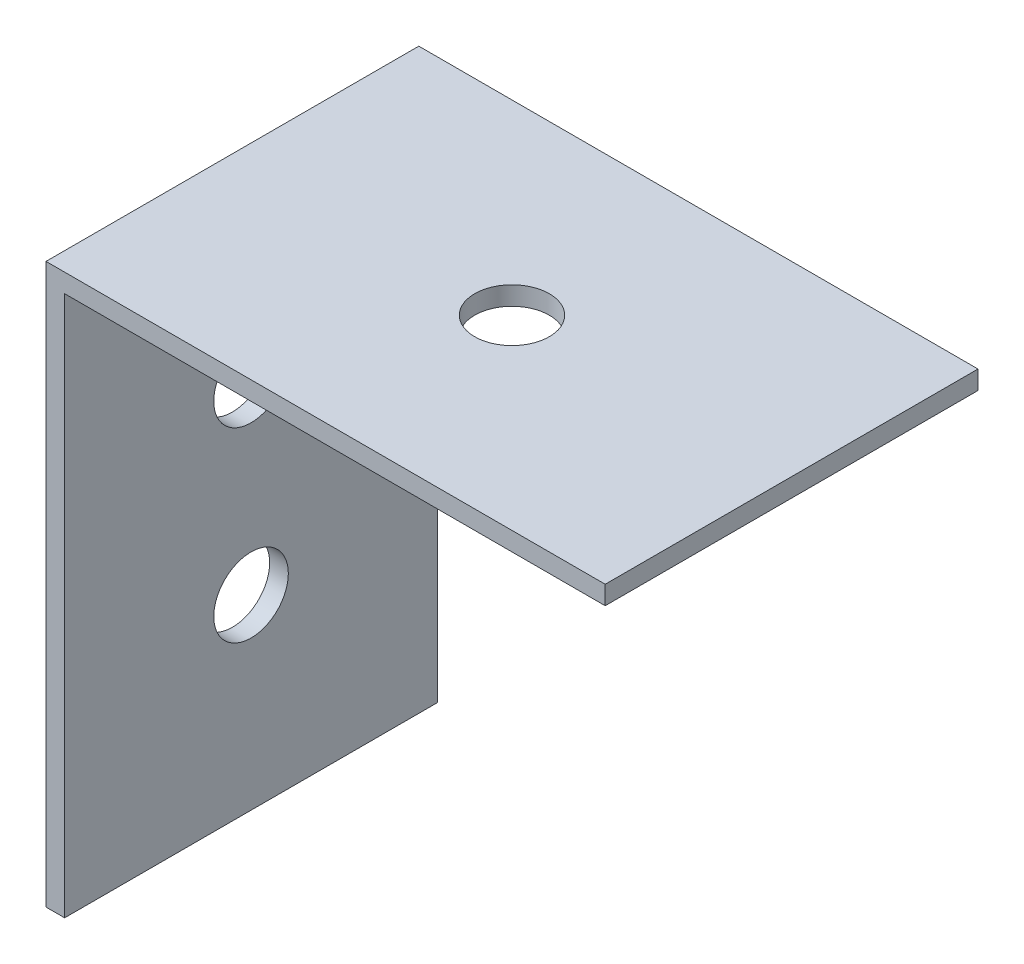
ISO-10303-21;
HEADER;
FILE_DESCRIPTION(('STEP AP214'),'2;1');
FILE_NAME('part.step','',(''),(''),'','','');
FILE_SCHEMA(('AUTOMOTIVE_DESIGN { 1 0 10303 214 1 1 1 1 }'));
ENDSEC;
DATA;
#1=APPLICATION_CONTEXT('core data for automotive mechanical design processes');
#2=APPLICATION_PROTOCOL_DEFINITION('international standard','automotive_design',2000,#1);
#3=PRODUCT_CONTEXT('',#1,'mechanical');
#4=PRODUCT('Part','Part','',(#3));
#5=PRODUCT_RELATED_PRODUCT_CATEGORY('part','',(#4));
#6=PRODUCT_DEFINITION_FORMATION('','',#4);
#7=PRODUCT_DEFINITION_CONTEXT('part definition',#1,'design');
#8=PRODUCT_DEFINITION('design','',#6,#7);
#9=PRODUCT_DEFINITION_SHAPE('','',#8);
#10=(LENGTH_UNIT() NAMED_UNIT(*) SI_UNIT(.MILLI.,.METRE.));
#11=(NAMED_UNIT(*) PLANE_ANGLE_UNIT() SI_UNIT($,.RADIAN.));
#12=(NAMED_UNIT(*) SI_UNIT($,.STERADIAN.) SOLID_ANGLE_UNIT());
#13=UNCERTAINTY_MEASURE_WITH_UNIT(LENGTH_MEASURE(1.E-05),#10,'distance_accuracy_value','');
#14=(GEOMETRIC_REPRESENTATION_CONTEXT(3) GLOBAL_UNCERTAINTY_ASSIGNED_CONTEXT((#13)) GLOBAL_UNIT_ASSIGNED_CONTEXT((#10,
#11,#12)) REPRESENTATION_CONTEXT('',''));
#15=CARTESIAN_POINT('',(0.,0.,0.));
#16=DIRECTION('',(0.,0.,1.));
#17=DIRECTION('',(1.,0.,0.));
#18=AXIS2_PLACEMENT_3D('',#15,#16,#17);
#19=CARTESIAN_POINT('',(1.,0.,0.));
#20=DIRECTION('',(-1.,0.,0.));
#21=DIRECTION('',(0.,0.,1.));
#22=AXIS2_PLACEMENT_3D('',#19,#20,#21);
#23=PLANE('',#22);
#24=CARTESIAN_POINT('',(1.,10.,-10.));
#25=DIRECTION('',(1.,0.,0.));
#26=DIRECTION('',(0.,0.,-1.));
#27=AXIS2_PLACEMENT_3D('',#24,#25,#26);
#28=CIRCLE('',#27,2.);
#29=CARTESIAN_POINT('',(1.,10.,-12.));
#30=VERTEX_POINT('',#29);
#31=EDGE_CURVE('E135',#30,#30,#28,.T.);
#32=ORIENTED_EDGE('',*,*,#31,.F.);
#33=EDGE_LOOP('',(#32));
#34=FACE_BOUND('',#33,.T.);
#35=CARTESIAN_POINT('',(1.,20.,-10.));
#36=DIRECTION('',(1.,0.,0.));
#37=DIRECTION('',(0.,0.,-1.));
#38=AXIS2_PLACEMENT_3D('',#35,#36,#37);
#39=CIRCLE('',#38,2.);
#40=CARTESIAN_POINT('',(1.,20.,-12.));
#41=VERTEX_POINT('',#40);
#42=EDGE_CURVE('E102',#41,#41,#39,.T.);
#43=ORIENTED_EDGE('',*,*,#42,.F.);
#44=EDGE_LOOP('',(#43));
#45=FACE_BOUND('',#44,.T.);
#46=DIRECTION('',(0.,0.,-1.));
#47=VECTOR('',#46,1.);
#48=CARTESIAN_POINT('',(1.,29.,0.));
#49=LINE('',#48,#47);
#50=CARTESIAN_POINT('',(1.,29.,0.));
#51=VERTEX_POINT('',#50);
#52=CARTESIAN_POINT('',(1.,29.,-20.));
#53=VERTEX_POINT('',#52);
#54=EDGE_CURVE('E49',#51,#53,#49,.T.);
#55=ORIENTED_EDGE('',*,*,#54,.F.);
#56=DIRECTION('',(0.,-1.,0.));
#57=VECTOR('',#56,1.);
#58=CARTESIAN_POINT('',(1.,0.,0.));
#59=LINE('',#58,#57);
#60=CARTESIAN_POINT('',(1.,0.,0.));
#61=VERTEX_POINT('',#60);
#62=EDGE_CURVE('E86',#51,#61,#59,.T.);
#63=ORIENTED_EDGE('',*,*,#62,.T.);
#64=DIRECTION('',(0.,0.,-1.));
#65=VECTOR('',#64,1.);
#66=CARTESIAN_POINT('',(1.,0.,0.));
#67=LINE('',#66,#65);
#68=CARTESIAN_POINT('',(1.,0.,-20.));
#69=VERTEX_POINT('',#68);
#70=EDGE_CURVE('E55',#61,#69,#67,.T.);
#71=ORIENTED_EDGE('',*,*,#70,.T.);
#72=DIRECTION('',(0.,1.,0.));
#73=VECTOR('',#72,1.);
#74=CARTESIAN_POINT('',(1.,0.,-20.));
#75=LINE('',#74,#73);
#76=EDGE_CURVE('E97',#69,#53,#75,.T.);
#77=ORIENTED_EDGE('',*,*,#76,.T.);
#78=EDGE_LOOP('',(#55,#63,#71,#77));
#79=FACE_BOUND('',#78,.T.);
#80=ADVANCED_FACE('F33',(#34,#45,#79),#23,.F.);
#81=CARTESIAN_POINT('',(0.,0.,0.));
#82=DIRECTION('',(-1.,0.,0.));
#83=DIRECTION('',(0.,0.,1.));
#84=AXIS2_PLACEMENT_3D('',#81,#82,#83);
#85=PLANE('',#84);
#86=CARTESIAN_POINT('',(0.,20.,-10.));
#87=DIRECTION('',(1.,0.,0.));
#88=DIRECTION('',(0.,0.,-1.));
#89=AXIS2_PLACEMENT_3D('',#86,#87,#88);
#90=CIRCLE('',#89,2.);
#91=CARTESIAN_POINT('',(0.,20.,-12.));
#92=VERTEX_POINT('',#91);
#93=EDGE_CURVE('E106',#92,#92,#90,.T.);
#94=ORIENTED_EDGE('',*,*,#93,.T.);
#95=EDGE_LOOP('',(#94));
#96=FACE_BOUND('',#95,.T.);
#97=DIRECTION('',(0.,-1.,0.));
#98=VECTOR('',#97,1.);
#99=CARTESIAN_POINT('',(0.,0.,0.));
#100=LINE('',#99,#98);
#101=CARTESIAN_POINT('',(0.,30.,0.));
#102=VERTEX_POINT('',#101);
#103=CARTESIAN_POINT('',(0.,0.,0.));
#104=VERTEX_POINT('',#103);
#105=EDGE_CURVE('E93',#102,#104,#100,.T.);
#106=ORIENTED_EDGE('',*,*,#105,.F.);
#107=DIRECTION('',(0.,0.,1.));
#108=VECTOR('',#107,1.);
#109=CARTESIAN_POINT('',(0.,30.,0.));
#110=LINE('',#109,#108);
#111=CARTESIAN_POINT('',(0.,30.,-20.));
#112=VERTEX_POINT('',#111);
#113=EDGE_CURVE('E75',#112,#102,#110,.T.);
#114=ORIENTED_EDGE('',*,*,#113,.F.);
#115=DIRECTION('',(0.,1.,0.));
#116=VECTOR('',#115,1.);
#117=CARTESIAN_POINT('',(0.,0.,-20.));
#118=LINE('',#117,#116);
#119=CARTESIAN_POINT('',(0.,0.,-20.));
#120=VERTEX_POINT('',#119);
#121=EDGE_CURVE('E87',#120,#112,#118,.T.);
#122=ORIENTED_EDGE('',*,*,#121,.F.);
#123=DIRECTION('',(0.,0.,-1.));
#124=VECTOR('',#123,1.);
#125=CARTESIAN_POINT('',(0.,0.,0.));
#126=LINE('',#125,#124);
#127=EDGE_CURVE('E101',#104,#120,#126,.T.);
#128=ORIENTED_EDGE('',*,*,#127,.F.);
#129=EDGE_LOOP('',(#106,#114,#122,#128));
#130=FACE_BOUND('',#129,.T.);
#131=CARTESIAN_POINT('',(0.,10.,-10.));
#132=DIRECTION('',(1.,0.,0.));
#133=DIRECTION('',(0.,0.,-1.));
#134=AXIS2_PLACEMENT_3D('',#131,#132,#133);
#135=CIRCLE('',#134,2.);
#136=CARTESIAN_POINT('',(0.,10.,-12.));
#137=VERTEX_POINT('',#136);
#138=EDGE_CURVE('E131',#137,#137,#135,.T.);
#139=ORIENTED_EDGE('',*,*,#138,.T.);
#140=EDGE_LOOP('',(#139));
#141=FACE_BOUND('',#140,.T.);
#142=ADVANCED_FACE('F99',(#96,#130,#141),#85,.T.);
#143=CARTESIAN_POINT('',(1.,0.,0.));
#144=DIRECTION('',(0.,0.,-1.));
#145=DIRECTION('',(-1.,0.,0.));
#146=AXIS2_PLACEMENT_3D('',#143,#144,#145);
#147=PLANE('',#146);
#148=ORIENTED_EDGE('',*,*,#105,.T.);
#149=DIRECTION('',(-1.,0.,0.));
#150=VECTOR('',#149,1.);
#151=CARTESIAN_POINT('',(1.,0.,0.));
#152=LINE('',#151,#150);
#153=EDGE_CURVE('E11',#61,#104,#152,.T.);
#154=ORIENTED_EDGE('',*,*,#153,.F.);
#155=ORIENTED_EDGE('',*,*,#62,.F.);
#156=DIRECTION('',(-1.,0.,0.));
#157=VECTOR('',#156,1.);
#158=CARTESIAN_POINT('',(30.,29.,0.));
#159=LINE('',#158,#157);
#160=CARTESIAN_POINT('',(30.,29.,0.));
#161=VERTEX_POINT('',#160);
#162=EDGE_CURVE('E122',#161,#51,#159,.T.);
#163=ORIENTED_EDGE('',*,*,#162,.F.);
#164=DIRECTION('',(0.,-1.,0.));
#165=VECTOR('',#164,1.);
#166=CARTESIAN_POINT('',(30.,30.,0.));
#167=LINE('',#166,#165);
#168=CARTESIAN_POINT('',(30.,30.,0.));
#169=VERTEX_POINT('',#168);
#170=EDGE_CURVE('E96',#169,#161,#167,.T.);
#171=ORIENTED_EDGE('',*,*,#170,.F.);
#172=DIRECTION('',(-1.,0.,0.));
#173=VECTOR('',#172,1.);
#174=CARTESIAN_POINT('',(1.,30.,0.));
#175=LINE('',#174,#173);
#176=EDGE_CURVE('E79',#169,#102,#175,.T.);
#177=ORIENTED_EDGE('',*,*,#176,.T.);
#178=EDGE_LOOP('',(#148,#154,#155,#163,#171,#177));
#179=FACE_BOUND('',#178,.T.);
#180=ADVANCED_FACE('F35',(#179),#147,.F.);
#181=CARTESIAN_POINT('',(1.,0.,0.));
#182=DIRECTION('',(0.,1.,0.));
#183=DIRECTION('',(0.,0.,1.));
#184=AXIS2_PLACEMENT_3D('',#181,#182,#183);
#185=PLANE('',#184);
#186=ORIENTED_EDGE('',*,*,#127,.T.);
#187=DIRECTION('',(-1.,0.,0.));
#188=VECTOR('',#187,1.);
#189=CARTESIAN_POINT('',(1.,0.,-20.));
#190=LINE('',#189,#188);
#191=EDGE_CURVE('E42',#69,#120,#190,.T.);
#192=ORIENTED_EDGE('',*,*,#191,.F.);
#193=ORIENTED_EDGE('',*,*,#70,.F.);
#194=ORIENTED_EDGE('',*,*,#153,.T.);
#195=EDGE_LOOP('',(#186,#192,#193,#194));
#196=FACE_BOUND('',#195,.T.);
#197=ADVANCED_FACE('F119',(#196),#185,.F.);
#198=CARTESIAN_POINT('',(1.,0.,-20.));
#199=DIRECTION('',(0.,0.,1.));
#200=DIRECTION('',(1.,0.,0.));
#201=AXIS2_PLACEMENT_3D('',#198,#199,#200);
#202=PLANE('',#201);
#203=ORIENTED_EDGE('',*,*,#121,.T.);
#204=DIRECTION('',(-1.,0.,0.));
#205=VECTOR('',#204,1.);
#206=CARTESIAN_POINT('',(1.,30.,-20.));
#207=LINE('',#206,#205);
#208=CARTESIAN_POINT('',(30.,30.,-20.));
#209=VERTEX_POINT('',#208);
#210=EDGE_CURVE('E82',#209,#112,#207,.T.);
#211=ORIENTED_EDGE('',*,*,#210,.F.);
#212=DIRECTION('',(0.,1.,0.));
#213=VECTOR('',#212,1.);
#214=CARTESIAN_POINT('',(30.,30.,-20.));
#215=LINE('',#214,#213);
#216=CARTESIAN_POINT('',(30.,29.,-20.));
#217=VERTEX_POINT('',#216);
#218=EDGE_CURVE('E154',#217,#209,#215,.T.);
#219=ORIENTED_EDGE('',*,*,#218,.F.);
#220=DIRECTION('',(-1.,0.,0.));
#221=VECTOR('',#220,1.);
#222=CARTESIAN_POINT('',(30.,29.,-20.));
#223=LINE('',#222,#221);
#224=EDGE_CURVE('E132',#217,#53,#223,.T.);
#225=ORIENTED_EDGE('',*,*,#224,.T.);
#226=ORIENTED_EDGE('',*,*,#76,.F.);
#227=ORIENTED_EDGE('',*,*,#191,.T.);
#228=EDGE_LOOP('',(#203,#211,#219,#225,#226,#227));
#229=FACE_BOUND('',#228,.T.);
#230=ADVANCED_FACE('F116',(#229),#202,.F.);
#231=CARTESIAN_POINT('',(1.,30.,0.));
#232=DIRECTION('',(0.,-1.,0.));
#233=DIRECTION('',(0.,0.,-1.));
#234=AXIS2_PLACEMENT_3D('',#231,#232,#233);
#235=PLANE('',#234);
#236=CARTESIAN_POINT('',(15.,30.,-10.));
#237=DIRECTION('',(0.,1.,0.));
#238=DIRECTION('',(0.,0.,1.));
#239=AXIS2_PLACEMENT_3D('',#236,#237,#238);
#240=CIRCLE('',#239,2.);
#241=CARTESIAN_POINT('',(15.,30.,-8.));
#242=VERTEX_POINT('',#241);
#243=EDGE_CURVE('E160',#242,#242,#240,.T.);
#244=ORIENTED_EDGE('',*,*,#243,.F.);
#245=EDGE_LOOP('',(#244));
#246=FACE_BOUND('',#245,.T.);
#247=ORIENTED_EDGE('',*,*,#113,.T.);
#248=ORIENTED_EDGE('',*,*,#176,.F.);
#249=DIRECTION('',(0.,0.,1.));
#250=VECTOR('',#249,1.);
#251=CARTESIAN_POINT('',(30.,30.,0.));
#252=LINE('',#251,#250);
#253=EDGE_CURVE('E137',#209,#169,#252,.T.);
#254=ORIENTED_EDGE('',*,*,#253,.F.);
#255=ORIENTED_EDGE('',*,*,#210,.T.);
#256=EDGE_LOOP('',(#247,#248,#254,#255));
#257=FACE_BOUND('',#256,.T.);
#258=ADVANCED_FACE('F77',(#246,#257),#235,.F.);
#259=CARTESIAN_POINT('',(1.,20.,-10.));
#260=DIRECTION('',(-1.,0.,0.));
#261=DIRECTION('',(0.,0.,1.));
#262=AXIS2_PLACEMENT_3D('',#259,#260,#261);
#263=CYLINDRICAL_SURFACE('',#262,2.);
#264=ORIENTED_EDGE('',*,*,#42,.T.);
#265=EDGE_LOOP('',(#264));
#266=FACE_BOUND('',#265,.T.);
#267=ORIENTED_EDGE('',*,*,#93,.F.);
#268=EDGE_LOOP('',(#267));
#269=FACE_BOUND('',#268,.T.);
#270=ADVANCED_FACE('F171',(#266,#269),#263,.F.);
#271=CARTESIAN_POINT('',(1.,10.,-10.));
#272=DIRECTION('',(-1.,0.,0.));
#273=DIRECTION('',(0.,0.,1.));
#274=AXIS2_PLACEMENT_3D('',#271,#272,#273);
#275=CYLINDRICAL_SURFACE('',#274,2.);
#276=ORIENTED_EDGE('',*,*,#31,.T.);
#277=EDGE_LOOP('',(#276));
#278=FACE_BOUND('',#277,.T.);
#279=ORIENTED_EDGE('',*,*,#138,.F.);
#280=EDGE_LOOP('',(#279));
#281=FACE_BOUND('',#280,.T.);
#282=ADVANCED_FACE('F177',(#278,#281),#275,.F.);
#283=CARTESIAN_POINT('',(30.,29.,0.));
#284=DIRECTION('',(0.,1.,0.));
#285=DIRECTION('',(0.,0.,1.));
#286=AXIS2_PLACEMENT_3D('',#283,#284,#285);
#287=PLANE('',#286);
#288=CARTESIAN_POINT('',(15.,29.,-10.));
#289=DIRECTION('',(0.,1.,0.));
#290=DIRECTION('',(0.,0.,1.));
#291=AXIS2_PLACEMENT_3D('',#288,#289,#290);
#292=CIRCLE('',#291,2.);
#293=CARTESIAN_POINT('',(15.,29.,-8.));
#294=VERTEX_POINT('',#293);
#295=EDGE_CURVE('E37',#294,#294,#292,.T.);
#296=ORIENTED_EDGE('',*,*,#295,.T.);
#297=EDGE_LOOP('',(#296));
#298=FACE_BOUND('',#297,.T.);
#299=ORIENTED_EDGE('',*,*,#54,.T.);
#300=ORIENTED_EDGE('',*,*,#224,.F.);
#301=DIRECTION('',(0.,0.,-1.));
#302=VECTOR('',#301,1.);
#303=CARTESIAN_POINT('',(30.,29.,0.));
#304=LINE('',#303,#302);
#305=EDGE_CURVE('E130',#161,#217,#304,.T.);
#306=ORIENTED_EDGE('',*,*,#305,.F.);
#307=ORIENTED_EDGE('',*,*,#162,.T.);
#308=EDGE_LOOP('',(#299,#300,#306,#307));
#309=FACE_BOUND('',#308,.T.);
#310=ADVANCED_FACE('F126',(#298,#309),#287,.F.);
#311=CARTESIAN_POINT('',(30.,0.,0.));
#312=DIRECTION('',(1.,0.,0.));
#313=DIRECTION('',(0.,0.,-1.));
#314=AXIS2_PLACEMENT_3D('',#311,#312,#313);
#315=PLANE('',#314);
#316=ORIENTED_EDGE('',*,*,#170,.T.);
#317=ORIENTED_EDGE('',*,*,#305,.T.);
#318=ORIENTED_EDGE('',*,*,#218,.T.);
#319=ORIENTED_EDGE('',*,*,#253,.T.);
#320=EDGE_LOOP('',(#316,#317,#318,#319));
#321=FACE_BOUND('',#320,.T.);
#322=ADVANCED_FACE('F152',(#321),#315,.T.);
#323=CARTESIAN_POINT('',(15.,0.,-10.));
#324=DIRECTION('',(0.,1.,0.));
#325=DIRECTION('',(0.,0.,1.));
#326=AXIS2_PLACEMENT_3D('',#323,#324,#325);
#327=CYLINDRICAL_SURFACE('',#326,2.);
#328=ORIENTED_EDGE('',*,*,#243,.T.);
#329=EDGE_LOOP('',(#328));
#330=FACE_BOUND('',#329,.T.);
#331=ORIENTED_EDGE('',*,*,#295,.F.);
#332=EDGE_LOOP('',(#331));
#333=FACE_BOUND('',#332,.T.);
#334=ADVANCED_FACE('F167',(#330,#333),#327,.F.);
#335=CLOSED_SHELL('',(#80,#142,#180,#197,#230,#258,#270,#282,#310,#322,#334));
#336=MANIFOLD_SOLID_BREP('B2',#335);
#337=ADVANCED_BREP_SHAPE_REPRESENTATION('',(#18,#336),#14);
#338=SHAPE_DEFINITION_REPRESENTATION(#9,#337);
ENDSEC;
END-ISO-10303-21;
